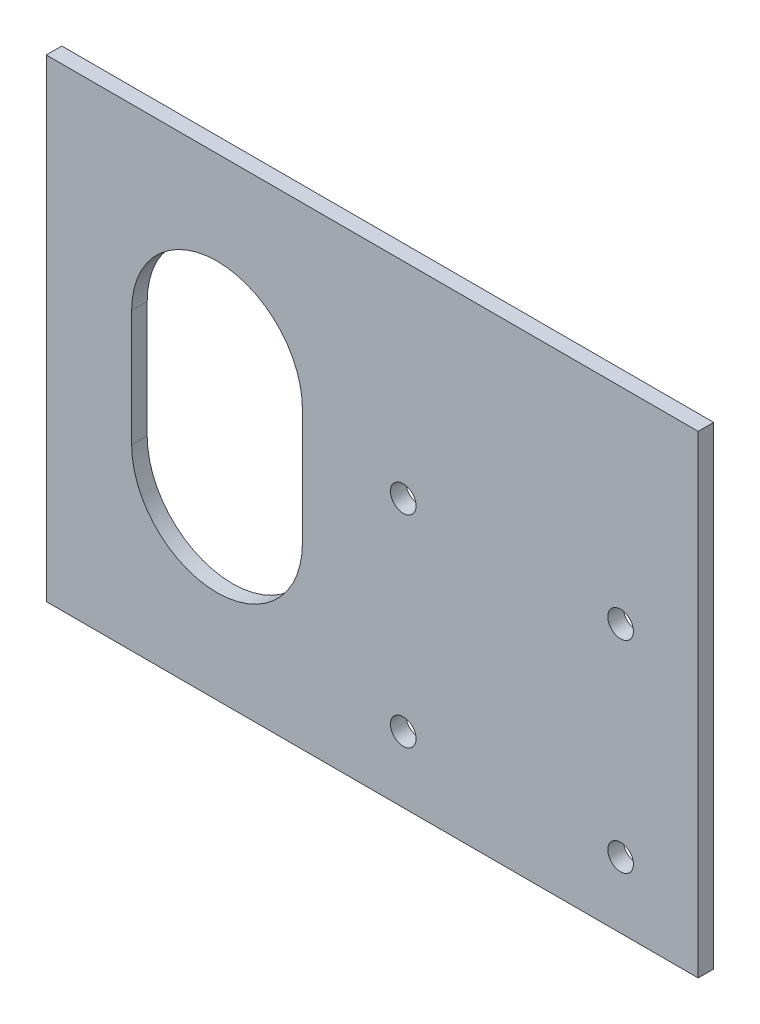
ISO-10303-21;
HEADER;
FILE_DESCRIPTION(('STEP AP214'),'2;1');
FILE_NAME('part.step','',(''),(''),'','','');
FILE_SCHEMA(('AUTOMOTIVE_DESIGN { 1 0 10303 214 1 1 1 1 }'));
ENDSEC;
DATA;
#1=APPLICATION_CONTEXT('core data for automotive mechanical design processes');
#2=APPLICATION_PROTOCOL_DEFINITION('international standard','automotive_design',2000,#1);
#3=PRODUCT_CONTEXT('',#1,'mechanical');
#4=PRODUCT('Part','Part','',(#3));
#5=PRODUCT_RELATED_PRODUCT_CATEGORY('part','',(#4));
#6=PRODUCT_DEFINITION_FORMATION('','',#4);
#7=PRODUCT_DEFINITION_CONTEXT('part definition',#1,'design');
#8=PRODUCT_DEFINITION('design','',#6,#7);
#9=PRODUCT_DEFINITION_SHAPE('','',#8);
#10=(LENGTH_UNIT() NAMED_UNIT(*) SI_UNIT(.MILLI.,.METRE.));
#11=(NAMED_UNIT(*) PLANE_ANGLE_UNIT() SI_UNIT($,.RADIAN.));
#12=(NAMED_UNIT(*) SI_UNIT($,.STERADIAN.) SOLID_ANGLE_UNIT());
#13=UNCERTAINTY_MEASURE_WITH_UNIT(LENGTH_MEASURE(1.E-05),#10,'distance_accuracy_value','');
#14=(GEOMETRIC_REPRESENTATION_CONTEXT(3) GLOBAL_UNCERTAINTY_ASSIGNED_CONTEXT((#13)) GLOBAL_UNIT_ASSIGNED_CONTEXT((#10,
#11,#12)) REPRESENTATION_CONTEXT('',''));
#15=CARTESIAN_POINT('',(0.,0.,0.));
#16=DIRECTION('',(0.,0.,1.));
#17=DIRECTION('',(1.,0.,0.));
#18=AXIS2_PLACEMENT_3D('',#15,#16,#17);
#19=CARTESIAN_POINT('',(0.,0.,2.));
#20=DIRECTION('',(0.,0.,1.));
#21=DIRECTION('',(1.,0.,0.));
#22=AXIS2_PLACEMENT_3D('',#19,#20,#21);
#23=PLANE('',#22);
#24=CARTESIAN_POINT('',(-78.4,49.6999999999999,2.));
#25=DIRECTION('',(0.,0.,1.));
#26=DIRECTION('',(1.,0.,0.));
#27=AXIS2_PLACEMENT_3D('',#24,#25,#26);
#28=CIRCLE('',#27,1.65);
#29=CARTESIAN_POINT('',(-76.75,49.6999999999999,2.));
#30=VERTEX_POINT('',#29);
#31=EDGE_CURVE('E140',#30,#30,#28,.T.);
#32=ORIENTED_EDGE('',*,*,#31,.F.);
#33=EDGE_LOOP('',(#32));
#34=FACE_BOUND('',#33,.T.);
#35=CARTESIAN_POINT('',(-106.4,23.6999999999999,2.));
#36=DIRECTION('',(0.,0.,1.));
#37=DIRECTION('',(1.,0.,0.));
#38=AXIS2_PLACEMENT_3D('',#35,#36,#37);
#39=CIRCLE('',#38,1.65);
#40=CARTESIAN_POINT('',(-104.75,23.6999999999999,2.));
#41=VERTEX_POINT('',#40);
#42=EDGE_CURVE('E152',#41,#41,#39,.T.);
#43=ORIENTED_EDGE('',*,*,#42,.F.);
#44=EDGE_LOOP('',(#43));
#45=FACE_BOUND('',#44,.T.);
#46=DIRECTION('',(0.,-1.,0.));
#47=VECTOR('',#46,1.);
#48=CARTESIAN_POINT('',(-152.4,76.2,2.));
#49=LINE('',#48,#47);
#50=CARTESIAN_POINT('',(-152.4,76.2,2.));
#51=VERTEX_POINT('',#50);
#52=CARTESIAN_POINT('',(-152.4,15.2,2.));
#53=VERTEX_POINT('',#52);
#54=EDGE_CURVE('E158',#51,#53,#49,.T.);
#55=ORIENTED_EDGE('',*,*,#54,.T.);
#56=DIRECTION('',(1.,0.,0.));
#57=VECTOR('',#56,1.);
#58=CARTESIAN_POINT('',(-152.4,15.2,2.));
#59=LINE('',#58,#57);
#60=CARTESIAN_POINT('',(-68.4,15.2,2.));
#61=VERTEX_POINT('',#60);
#62=EDGE_CURVE('E161',#53,#61,#59,.T.);
#63=ORIENTED_EDGE('',*,*,#62,.T.);
#64=DIRECTION('',(0.,1.,0.));
#65=VECTOR('',#64,1.);
#66=CARTESIAN_POINT('',(-68.4,76.2,2.));
#67=LINE('',#66,#65);
#68=CARTESIAN_POINT('',(-68.4,76.2,2.));
#69=VERTEX_POINT('',#68);
#70=EDGE_CURVE('E164',#61,#69,#67,.T.);
#71=ORIENTED_EDGE('',*,*,#70,.T.);
#72=DIRECTION('',(-1.,0.,0.));
#73=VECTOR('',#72,1.);
#74=CARTESIAN_POINT('',(-152.4,76.2,2.));
#75=LINE('',#74,#73);
#76=EDGE_CURVE('E166',#69,#51,#75,.T.);
#77=ORIENTED_EDGE('',*,*,#76,.T.);
#78=EDGE_LOOP('',(#55,#63,#71,#77));
#79=FACE_BOUND('',#78,.T.);
#80=CARTESIAN_POINT('',(-78.4,23.6999999999999,2.));
#81=DIRECTION('',(0.,0.,1.));
#82=DIRECTION('',(1.,0.,0.));
#83=AXIS2_PLACEMENT_3D('',#80,#81,#82);
#84=CIRCLE('',#83,1.65);
#85=CARTESIAN_POINT('',(-76.75,23.6999999999999,2.));
#86=VERTEX_POINT('',#85);
#87=EDGE_CURVE('E146',#86,#86,#84,.T.);
#88=ORIENTED_EDGE('',*,*,#87,.F.);
#89=EDGE_LOOP('',(#88));
#90=FACE_BOUND('',#89,.T.);
#91=CARTESIAN_POINT('',(-106.4,49.6999999999999,2.));
#92=DIRECTION('',(0.,0.,1.));
#93=DIRECTION('',(1.,0.,0.));
#94=AXIS2_PLACEMENT_3D('',#91,#92,#93);
#95=CIRCLE('',#94,1.65);
#96=CARTESIAN_POINT('',(-104.75,49.6999999999999,2.));
#97=VERTEX_POINT('',#96);
#98=EDGE_CURVE('E134',#97,#97,#95,.T.);
#99=ORIENTED_EDGE('',*,*,#98,.F.);
#100=EDGE_LOOP('',(#99));
#101=FACE_BOUND('',#100,.T.);
#102=DIRECTION('',(0.,-1.,0.));
#103=VECTOR('',#102,1.);
#104=CARTESIAN_POINT('',(-141.4,53.2,2.));
#105=LINE('',#104,#103);
#106=CARTESIAN_POINT('',(-141.4,53.2,2.));
#107=VERTEX_POINT('',#106);
#108=CARTESIAN_POINT('',(-141.4,38.2,2.));
#109=VERTEX_POINT('',#108);
#110=EDGE_CURVE('E106',#107,#109,#105,.T.);
#111=ORIENTED_EDGE('',*,*,#110,.F.);
#112=CARTESIAN_POINT('',(-130.4,53.2,2.));
#113=DIRECTION('',(0.,0.,1.));
#114=DIRECTION('',(1.,0.,0.));
#115=AXIS2_PLACEMENT_3D('',#112,#113,#114);
#116=CIRCLE('',#115,11.);
#117=CARTESIAN_POINT('',(-119.4,53.2,2.));
#118=VERTEX_POINT('',#117);
#119=EDGE_CURVE('E98',#118,#107,#116,.T.);
#120=ORIENTED_EDGE('',*,*,#119,.F.);
#121=DIRECTION('',(0.,1.,0.));
#122=VECTOR('',#121,1.);
#123=CARTESIAN_POINT('',(-119.4,53.2,2.));
#124=LINE('',#123,#122);
#125=CARTESIAN_POINT('',(-119.4,38.2,2.));
#126=VERTEX_POINT('',#125);
#127=EDGE_CURVE('E120',#126,#118,#124,.T.);
#128=ORIENTED_EDGE('',*,*,#127,.F.);
#129=CARTESIAN_POINT('',(-130.4,38.2,2.));
#130=DIRECTION('',(0.,0.,1.));
#131=DIRECTION('',(1.,0.,0.));
#132=AXIS2_PLACEMENT_3D('',#129,#130,#131);
#133=CIRCLE('',#132,11.);
#134=EDGE_CURVE('E118',#109,#126,#133,.T.);
#135=ORIENTED_EDGE('',*,*,#134,.F.);
#136=EDGE_LOOP('',(#111,#120,#128,#135));
#137=FACE_BOUND('',#136,.T.);
#138=ADVANCED_FACE('F33',(#34,#45,#79,#90,#101,#137),#23,.T.);
#139=CARTESIAN_POINT('',(0.,0.,0.));
#140=DIRECTION('',(0.,0.,1.));
#141=DIRECTION('',(1.,0.,0.));
#142=AXIS2_PLACEMENT_3D('',#139,#140,#141);
#143=PLANE('',#142);
#144=CARTESIAN_POINT('',(-106.4,49.6999999999999,0.));
#145=DIRECTION('',(0.,0.,1.));
#146=DIRECTION('',(1.,0.,0.));
#147=AXIS2_PLACEMENT_3D('',#144,#145,#146);
#148=CIRCLE('',#147,1.65);
#149=CARTESIAN_POINT('',(-104.75,49.6999999999999,0.));
#150=VERTEX_POINT('',#149);
#151=EDGE_CURVE('E114',#150,#150,#148,.T.);
#152=ORIENTED_EDGE('',*,*,#151,.T.);
#153=EDGE_LOOP('',(#152));
#154=FACE_BOUND('',#153,.T.);
#155=CARTESIAN_POINT('',(-78.4,49.6999999999999,0.));
#156=DIRECTION('',(0.,0.,1.));
#157=DIRECTION('',(1.,0.,0.));
#158=AXIS2_PLACEMENT_3D('',#155,#156,#157);
#159=CIRCLE('',#158,1.65);
#160=CARTESIAN_POINT('',(-76.75,49.6999999999999,0.));
#161=VERTEX_POINT('',#160);
#162=EDGE_CURVE('E137',#161,#161,#159,.T.);
#163=ORIENTED_EDGE('',*,*,#162,.T.);
#164=EDGE_LOOP('',(#163));
#165=FACE_BOUND('',#164,.T.);
#166=CARTESIAN_POINT('',(-78.4,23.6999999999999,0.));
#167=DIRECTION('',(0.,0.,1.));
#168=DIRECTION('',(1.,0.,0.));
#169=AXIS2_PLACEMENT_3D('',#166,#167,#168);
#170=CIRCLE('',#169,1.65);
#171=CARTESIAN_POINT('',(-76.75,23.6999999999999,0.));
#172=VERTEX_POINT('',#171);
#173=EDGE_CURVE('E143',#172,#172,#170,.T.);
#174=ORIENTED_EDGE('',*,*,#173,.T.);
#175=EDGE_LOOP('',(#174));
#176=FACE_BOUND('',#175,.T.);
#177=CARTESIAN_POINT('',(-106.4,23.6999999999999,0.));
#178=DIRECTION('',(0.,0.,1.));
#179=DIRECTION('',(1.,0.,0.));
#180=AXIS2_PLACEMENT_3D('',#177,#178,#179);
#181=CIRCLE('',#180,1.65);
#182=CARTESIAN_POINT('',(-104.75,23.6999999999999,0.));
#183=VERTEX_POINT('',#182);
#184=EDGE_CURVE('E149',#183,#183,#181,.T.);
#185=ORIENTED_EDGE('',*,*,#184,.T.);
#186=EDGE_LOOP('',(#185));
#187=FACE_BOUND('',#186,.T.);
#188=DIRECTION('',(0.,-1.,0.));
#189=VECTOR('',#188,1.);
#190=CARTESIAN_POINT('',(-152.4,76.2,0.));
#191=LINE('',#190,#189);
#192=CARTESIAN_POINT('',(-152.4,76.2,0.));
#193=VERTEX_POINT('',#192);
#194=CARTESIAN_POINT('',(-152.4,15.2,0.));
#195=VERTEX_POINT('',#194);
#196=EDGE_CURVE('E155',#193,#195,#191,.T.);
#197=ORIENTED_EDGE('',*,*,#196,.F.);
#198=DIRECTION('',(-1.,0.,0.));
#199=VECTOR('',#198,1.);
#200=CARTESIAN_POINT('',(-152.4,76.2,0.));
#201=LINE('',#200,#199);
#202=CARTESIAN_POINT('',(-68.4,76.2,0.));
#203=VERTEX_POINT('',#202);
#204=EDGE_CURVE('E162',#203,#193,#201,.T.);
#205=ORIENTED_EDGE('',*,*,#204,.F.);
#206=DIRECTION('',(0.,1.,0.));
#207=VECTOR('',#206,1.);
#208=CARTESIAN_POINT('',(-68.4,76.2,0.));
#209=LINE('',#208,#207);
#210=CARTESIAN_POINT('',(-68.4,15.2,0.));
#211=VERTEX_POINT('',#210);
#212=EDGE_CURVE('E173',#211,#203,#209,.T.);
#213=ORIENTED_EDGE('',*,*,#212,.F.);
#214=DIRECTION('',(1.,0.,0.));
#215=VECTOR('',#214,1.);
#216=CARTESIAN_POINT('',(-152.4,15.2,0.));
#217=LINE('',#216,#215);
#218=EDGE_CURVE('E171',#195,#211,#217,.T.);
#219=ORIENTED_EDGE('',*,*,#218,.F.);
#220=EDGE_LOOP('',(#197,#205,#213,#219));
#221=FACE_BOUND('',#220,.T.);
#222=CARTESIAN_POINT('',(-130.4,53.2,0.));
#223=DIRECTION('',(0.,0.,1.));
#224=DIRECTION('',(1.,0.,0.));
#225=AXIS2_PLACEMENT_3D('',#222,#223,#224);
#226=CIRCLE('',#225,11.);
#227=CARTESIAN_POINT('',(-119.4,53.2,0.));
#228=VERTEX_POINT('',#227);
#229=CARTESIAN_POINT('',(-141.4,53.2,0.));
#230=VERTEX_POINT('',#229);
#231=EDGE_CURVE('E56',#228,#230,#226,.T.);
#232=ORIENTED_EDGE('',*,*,#231,.T.);
#233=DIRECTION('',(0.,-1.,0.));
#234=VECTOR('',#233,1.);
#235=CARTESIAN_POINT('',(-141.4,53.2,0.));
#236=LINE('',#235,#234);
#237=CARTESIAN_POINT('',(-141.4,38.2,0.));
#238=VERTEX_POINT('',#237);
#239=EDGE_CURVE('E113',#230,#238,#236,.T.);
#240=ORIENTED_EDGE('',*,*,#239,.T.);
#241=CARTESIAN_POINT('',(-130.4,38.2,0.));
#242=DIRECTION('',(0.,0.,1.));
#243=DIRECTION('',(1.,0.,0.));
#244=AXIS2_PLACEMENT_3D('',#241,#242,#243);
#245=CIRCLE('',#244,11.);
#246=CARTESIAN_POINT('',(-119.4,38.2,0.));
#247=VERTEX_POINT('',#246);
#248=EDGE_CURVE('E126',#238,#247,#245,.T.);
#249=ORIENTED_EDGE('',*,*,#248,.T.);
#250=DIRECTION('',(0.,1.,0.));
#251=VECTOR('',#250,1.);
#252=CARTESIAN_POINT('',(-119.4,53.2,0.));
#253=LINE('',#252,#251);
#254=EDGE_CURVE('E107',#247,#228,#253,.T.);
#255=ORIENTED_EDGE('',*,*,#254,.T.);
#256=EDGE_LOOP('',(#232,#240,#249,#255));
#257=FACE_BOUND('',#256,.T.);
#258=ADVANCED_FACE('F191',(#154,#165,#176,#187,#221,#257),#143,.F.);
#259=CARTESIAN_POINT('',(-152.4,76.2,2.));
#260=DIRECTION('',(1.,0.,0.));
#261=DIRECTION('',(0.,0.,-1.));
#262=AXIS2_PLACEMENT_3D('',#259,#260,#261);
#263=PLANE('',#262);
#264=ORIENTED_EDGE('',*,*,#196,.T.);
#265=DIRECTION('',(0.,0.,-1.));
#266=VECTOR('',#265,1.);
#267=CARTESIAN_POINT('',(-152.4,15.2,2.));
#268=LINE('',#267,#266);
#269=EDGE_CURVE('E11',#53,#195,#268,.T.);
#270=ORIENTED_EDGE('',*,*,#269,.F.);
#271=ORIENTED_EDGE('',*,*,#54,.F.);
#272=DIRECTION('',(0.,0.,-1.));
#273=VECTOR('',#272,1.);
#274=CARTESIAN_POINT('',(-152.4,76.2,2.));
#275=LINE('',#274,#273);
#276=EDGE_CURVE('E168',#51,#193,#275,.T.);
#277=ORIENTED_EDGE('',*,*,#276,.T.);
#278=EDGE_LOOP('',(#264,#270,#271,#277));
#279=FACE_BOUND('',#278,.T.);
#280=ADVANCED_FACE('F35',(#279),#263,.F.);
#281=CARTESIAN_POINT('',(-152.4,15.2,2.));
#282=DIRECTION('',(0.,1.,0.));
#283=DIRECTION('',(0.,0.,1.));
#284=AXIS2_PLACEMENT_3D('',#281,#282,#283);
#285=PLANE('',#284);
#286=ORIENTED_EDGE('',*,*,#218,.T.);
#287=DIRECTION('',(0.,0.,-1.));
#288=VECTOR('',#287,1.);
#289=CARTESIAN_POINT('',(-68.4,15.2,2.));
#290=LINE('',#289,#288);
#291=EDGE_CURVE('E41',#61,#211,#290,.T.);
#292=ORIENTED_EDGE('',*,*,#291,.F.);
#293=ORIENTED_EDGE('',*,*,#62,.F.);
#294=ORIENTED_EDGE('',*,*,#269,.T.);
#295=EDGE_LOOP('',(#286,#292,#293,#294));
#296=FACE_BOUND('',#295,.T.);
#297=ADVANCED_FACE('F202',(#296),#285,.F.);
#298=CARTESIAN_POINT('',(-68.4,76.2,2.));
#299=DIRECTION('',(-1.,0.,0.));
#300=DIRECTION('',(0.,-1.,0.));
#301=AXIS2_PLACEMENT_3D('',#298,#299,#300);
#302=PLANE('',#301);
#303=ORIENTED_EDGE('',*,*,#212,.T.);
#304=DIRECTION('',(0.,0.,-1.));
#305=VECTOR('',#304,1.);
#306=CARTESIAN_POINT('',(-68.4,76.2,2.));
#307=LINE('',#306,#305);
#308=EDGE_CURVE('E178',#69,#203,#307,.T.);
#309=ORIENTED_EDGE('',*,*,#308,.F.);
#310=ORIENTED_EDGE('',*,*,#70,.F.);
#311=ORIENTED_EDGE('',*,*,#291,.T.);
#312=EDGE_LOOP('',(#303,#309,#310,#311));
#313=FACE_BOUND('',#312,.T.);
#314=ADVANCED_FACE('F185',(#313),#302,.F.);
#315=CARTESIAN_POINT('',(-152.4,76.2,2.));
#316=DIRECTION('',(0.,-1.,0.));
#317=DIRECTION('',(0.,0.,-1.));
#318=AXIS2_PLACEMENT_3D('',#315,#316,#317);
#319=PLANE('',#318);
#320=ORIENTED_EDGE('',*,*,#204,.T.);
#321=ORIENTED_EDGE('',*,*,#276,.F.);
#322=ORIENTED_EDGE('',*,*,#76,.F.);
#323=ORIENTED_EDGE('',*,*,#308,.T.);
#324=EDGE_LOOP('',(#320,#321,#322,#323));
#325=FACE_BOUND('',#324,.T.);
#326=ADVANCED_FACE('F195',(#325),#319,.F.);
#327=CARTESIAN_POINT('',(-106.4,23.6999999999999,2.));
#328=DIRECTION('',(0.,0.,-1.));
#329=DIRECTION('',(-1.,0.,0.));
#330=AXIS2_PLACEMENT_3D('',#327,#328,#329);
#331=CYLINDRICAL_SURFACE('',#330,1.65);
#332=ORIENTED_EDGE('',*,*,#42,.T.);
#333=EDGE_LOOP('',(#332));
#334=FACE_BOUND('',#333,.T.);
#335=ORIENTED_EDGE('',*,*,#184,.F.);
#336=EDGE_LOOP('',(#335));
#337=FACE_BOUND('',#336,.T.);
#338=ADVANCED_FACE('F220',(#334,#337),#331,.F.);
#339=CARTESIAN_POINT('',(-78.4,23.6999999999999,2.));
#340=DIRECTION('',(0.,0.,-1.));
#341=DIRECTION('',(-1.,0.,0.));
#342=AXIS2_PLACEMENT_3D('',#339,#340,#341);
#343=CYLINDRICAL_SURFACE('',#342,1.65);
#344=ORIENTED_EDGE('',*,*,#87,.T.);
#345=EDGE_LOOP('',(#344));
#346=FACE_BOUND('',#345,.T.);
#347=ORIENTED_EDGE('',*,*,#173,.F.);
#348=EDGE_LOOP('',(#347));
#349=FACE_BOUND('',#348,.T.);
#350=ADVANCED_FACE('F227',(#346,#349),#343,.F.);
#351=CARTESIAN_POINT('',(-78.4,49.6999999999999,2.));
#352=DIRECTION('',(0.,0.,-1.));
#353=DIRECTION('',(-1.,0.,0.));
#354=AXIS2_PLACEMENT_3D('',#351,#352,#353);
#355=CYLINDRICAL_SURFACE('',#354,1.65);
#356=ORIENTED_EDGE('',*,*,#31,.T.);
#357=EDGE_LOOP('',(#356));
#358=FACE_BOUND('',#357,.T.);
#359=ORIENTED_EDGE('',*,*,#162,.F.);
#360=EDGE_LOOP('',(#359));
#361=FACE_BOUND('',#360,.T.);
#362=ADVANCED_FACE('F232',(#358,#361),#355,.F.);
#363=CARTESIAN_POINT('',(-106.4,49.6999999999999,2.));
#364=DIRECTION('',(0.,0.,-1.));
#365=DIRECTION('',(-1.,0.,0.));
#366=AXIS2_PLACEMENT_3D('',#363,#364,#365);
#367=CYLINDRICAL_SURFACE('',#366,1.65);
#368=ORIENTED_EDGE('',*,*,#98,.T.);
#369=EDGE_LOOP('',(#368));
#370=FACE_BOUND('',#369,.T.);
#371=ORIENTED_EDGE('',*,*,#151,.F.);
#372=EDGE_LOOP('',(#371));
#373=FACE_BOUND('',#372,.T.);
#374=ADVANCED_FACE('F241',(#370,#373),#367,.F.);
#375=CARTESIAN_POINT('',(-130.4,53.2,2.));
#376=DIRECTION('',(0.,0.,-1.));
#377=DIRECTION('',(-1.,0.,0.));
#378=AXIS2_PLACEMENT_3D('',#375,#376,#377);
#379=CYLINDRICAL_SURFACE('',#378,11.);
#380=ORIENTED_EDGE('',*,*,#231,.F.);
#381=DIRECTION('',(0.,0.,-1.));
#382=VECTOR('',#381,1.);
#383=CARTESIAN_POINT('',(-119.4,53.2,2.));
#384=LINE('',#383,#382);
#385=EDGE_CURVE('E102',#118,#228,#384,.T.);
#386=ORIENTED_EDGE('',*,*,#385,.F.);
#387=ORIENTED_EDGE('',*,*,#119,.T.);
#388=DIRECTION('',(0.,0.,-1.));
#389=VECTOR('',#388,1.);
#390=CARTESIAN_POINT('',(-141.4,53.2,2.));
#391=LINE('',#390,#389);
#392=EDGE_CURVE('E101',#107,#230,#391,.T.);
#393=ORIENTED_EDGE('',*,*,#392,.T.);
#394=EDGE_LOOP('',(#380,#386,#387,#393));
#395=FACE_BOUND('',#394,.T.);
#396=ADVANCED_FACE('F100',(#395),#379,.F.);
#397=CARTESIAN_POINT('',(-141.4,53.2,2.));
#398=DIRECTION('',(1.,0.,0.));
#399=DIRECTION('',(0.,0.,-1.));
#400=AXIS2_PLACEMENT_3D('',#397,#398,#399);
#401=PLANE('',#400);
#402=ORIENTED_EDGE('',*,*,#239,.F.);
#403=ORIENTED_EDGE('',*,*,#392,.F.);
#404=ORIENTED_EDGE('',*,*,#110,.T.);
#405=DIRECTION('',(0.,0.,-1.));
#406=VECTOR('',#405,1.);
#407=CARTESIAN_POINT('',(-141.4,38.2,2.));
#408=LINE('',#407,#406);
#409=EDGE_CURVE('E115',#109,#238,#408,.T.);
#410=ORIENTED_EDGE('',*,*,#409,.T.);
#411=EDGE_LOOP('',(#402,#403,#404,#410));
#412=FACE_BOUND('',#411,.T.);
#413=ADVANCED_FACE('F110',(#412),#401,.T.);
#414=CARTESIAN_POINT('',(-130.4,38.2,2.));
#415=DIRECTION('',(0.,0.,-1.));
#416=DIRECTION('',(-1.,0.,0.));
#417=AXIS2_PLACEMENT_3D('',#414,#415,#416);
#418=CYLINDRICAL_SURFACE('',#417,11.);
#419=ORIENTED_EDGE('',*,*,#248,.F.);
#420=ORIENTED_EDGE('',*,*,#409,.F.);
#421=ORIENTED_EDGE('',*,*,#134,.T.);
#422=DIRECTION('',(0.,0.,-1.));
#423=VECTOR('',#422,1.);
#424=CARTESIAN_POINT('',(-119.4,38.2,2.));
#425=LINE('',#424,#423);
#426=EDGE_CURVE('E48',#126,#247,#425,.T.);
#427=ORIENTED_EDGE('',*,*,#426,.T.);
#428=EDGE_LOOP('',(#419,#420,#421,#427));
#429=FACE_BOUND('',#428,.T.);
#430=ADVANCED_FACE('F253',(#429),#418,.F.);
#431=CARTESIAN_POINT('',(-119.4,53.2,2.));
#432=DIRECTION('',(-1.,0.,0.));
#433=DIRECTION('',(0.,0.,1.));
#434=AXIS2_PLACEMENT_3D('',#431,#432,#433);
#435=PLANE('',#434);
#436=ORIENTED_EDGE('',*,*,#254,.F.);
#437=ORIENTED_EDGE('',*,*,#426,.F.);
#438=ORIENTED_EDGE('',*,*,#127,.T.);
#439=ORIENTED_EDGE('',*,*,#385,.T.);
#440=EDGE_LOOP('',(#436,#437,#438,#439));
#441=FACE_BOUND('',#440,.T.);
#442=ADVANCED_FACE('F256',(#441),#435,.T.);
#443=CLOSED_SHELL('',(#138,#258,#280,#297,#314,#326,#338,#350,#362,#374,#396,#413,#430,#442));
#444=MANIFOLD_SOLID_BREP('B2',#443);
#445=ADVANCED_BREP_SHAPE_REPRESENTATION('',(#18,#444),#14);
#446=SHAPE_DEFINITION_REPRESENTATION(#9,#445);
ENDSEC;
END-ISO-10303-21;
